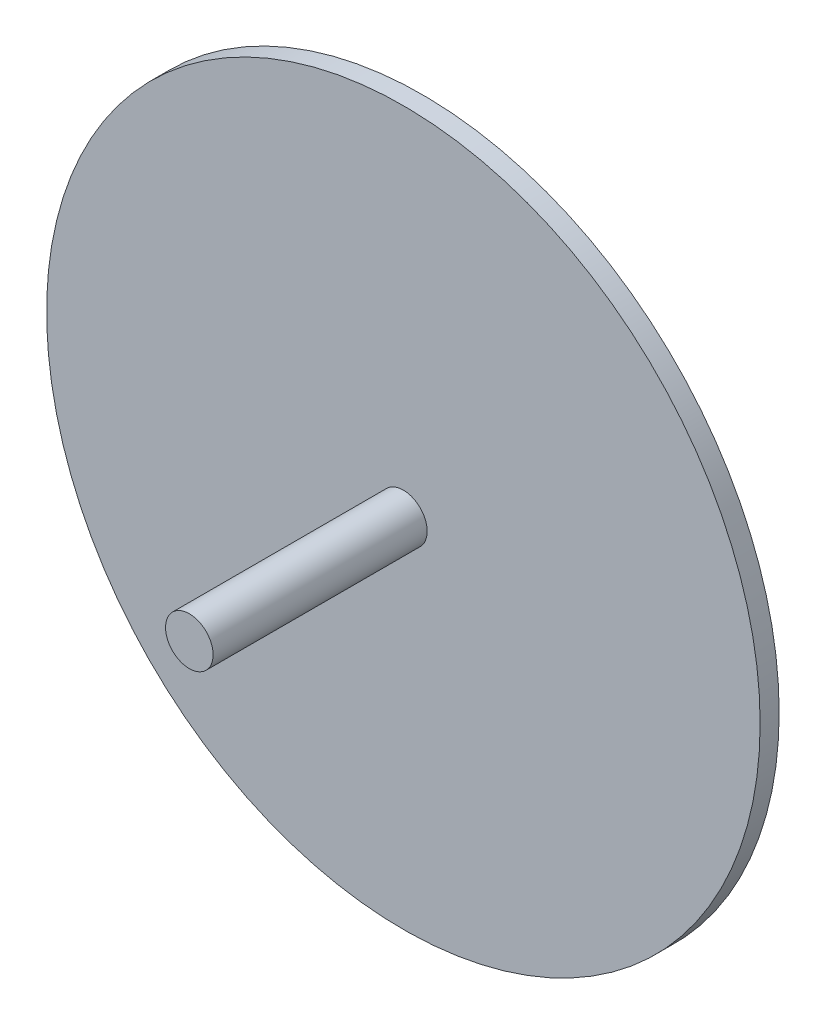
ISO-10303-21;
HEADER;
FILE_DESCRIPTION(('STEP AP214'),'2;1');
FILE_NAME('part.step','',(''),(''),'','','');
FILE_SCHEMA(('AUTOMOTIVE_DESIGN { 1 0 10303 214 1 1 1 1 }'));
ENDSEC;
DATA;
#1=APPLICATION_CONTEXT('core data for automotive mechanical design processes');
#2=APPLICATION_PROTOCOL_DEFINITION('international standard','automotive_design',2000,#1);
#3=PRODUCT_CONTEXT('',#1,'mechanical');
#4=PRODUCT('Part','Part','',(#3));
#5=PRODUCT_RELATED_PRODUCT_CATEGORY('part','',(#4));
#6=PRODUCT_DEFINITION_FORMATION('','',#4);
#7=PRODUCT_DEFINITION_CONTEXT('part definition',#1,'design');
#8=PRODUCT_DEFINITION('design','',#6,#7);
#9=PRODUCT_DEFINITION_SHAPE('','',#8);
#10=(LENGTH_UNIT() NAMED_UNIT(*) SI_UNIT(.MILLI.,.METRE.));
#11=(NAMED_UNIT(*) PLANE_ANGLE_UNIT() SI_UNIT($,.RADIAN.));
#12=(NAMED_UNIT(*) SI_UNIT($,.STERADIAN.) SOLID_ANGLE_UNIT());
#13=UNCERTAINTY_MEASURE_WITH_UNIT(LENGTH_MEASURE(1.E-05),#10,'distance_accuracy_value','');
#14=(GEOMETRIC_REPRESENTATION_CONTEXT(3) GLOBAL_UNCERTAINTY_ASSIGNED_CONTEXT((#13)) GLOBAL_UNIT_ASSIGNED_CONTEXT((#10,
#11,#12)) REPRESENTATION_CONTEXT('',''));
#15=CARTESIAN_POINT('',(0.,0.,0.));
#16=DIRECTION('',(0.,0.,1.));
#17=DIRECTION('',(1.,0.,0.));
#18=AXIS2_PLACEMENT_3D('',#15,#16,#17);
#19=CARTESIAN_POINT('',(0.,0.,4.));
#20=DIRECTION('',(0.,0.,-1.));
#21=DIRECTION('',(-1.,0.,0.));
#22=AXIS2_PLACEMENT_3D('',#19,#20,#21);
#23=CYLINDRICAL_SURFACE('',#22,75.);
#24=CARTESIAN_POINT('',(0.,0.,4.));
#25=DIRECTION('',(0.,0.,1.));
#26=DIRECTION('',(1.,0.,0.));
#27=AXIS2_PLACEMENT_3D('',#24,#25,#26);
#28=CIRCLE('',#27,75.);
#29=CARTESIAN_POINT('',(75.,0.,4.));
#30=VERTEX_POINT('',#29);
#31=EDGE_CURVE('E10',#30,#30,#28,.T.);
#32=ORIENTED_EDGE('',*,*,#31,.F.);
#33=EDGE_LOOP('',(#32));
#34=FACE_BOUND('',#33,.T.);
#35=CARTESIAN_POINT('',(0.,0.,0.));
#36=DIRECTION('',(0.,0.,1.));
#37=DIRECTION('',(1.,0.,0.));
#38=AXIS2_PLACEMENT_3D('',#35,#36,#37);
#39=CIRCLE('',#38,75.);
#40=CARTESIAN_POINT('',(75.,0.,0.));
#41=VERTEX_POINT('',#40);
#42=EDGE_CURVE('E46',#41,#41,#39,.T.);
#43=ORIENTED_EDGE('',*,*,#42,.T.);
#44=EDGE_LOOP('',(#43));
#45=FACE_BOUND('',#44,.T.);
#46=ADVANCED_FACE('F43',(#34,#45),#23,.T.);
#47=CARTESIAN_POINT('',(0.,0.,4.));
#48=DIRECTION('',(0.,0.,1.));
#49=DIRECTION('',(1.,0.,0.));
#50=AXIS2_PLACEMENT_3D('',#47,#48,#49);
#51=PLANE('',#50);
#52=CARTESIAN_POINT('',(0.,0.,4.));
#53=DIRECTION('',(0.,0.,1.));
#54=DIRECTION('',(1.,0.,0.));
#55=AXIS2_PLACEMENT_3D('',#52,#53,#54);
#56=CIRCLE('',#55,5.);
#57=CARTESIAN_POINT('',(5.,0.,4.));
#58=VERTEX_POINT('',#57);
#59=EDGE_CURVE('E57',#58,#58,#56,.T.);
#60=ORIENTED_EDGE('',*,*,#59,.F.);
#61=EDGE_LOOP('',(#60));
#62=FACE_BOUND('',#61,.T.);
#63=ORIENTED_EDGE('',*,*,#31,.T.);
#64=EDGE_LOOP('',(#63));
#65=FACE_BOUND('',#64,.T.);
#66=ADVANCED_FACE('F74',(#62,#65),#51,.T.);
#67=CARTESIAN_POINT('',(0.,0.,0.));
#68=DIRECTION('',(0.,0.,1.));
#69=DIRECTION('',(1.,0.,0.));
#70=AXIS2_PLACEMENT_3D('',#67,#68,#69);
#71=PLANE('',#70);
#72=ORIENTED_EDGE('',*,*,#42,.F.);
#73=EDGE_LOOP('',(#72));
#74=FACE_BOUND('',#73,.T.);
#75=ADVANCED_FACE('F70',(#74),#71,.F.);
#76=CARTESIAN_POINT('',(0.,0.,49.));
#77=DIRECTION('',(0.,0.,-1.));
#78=DIRECTION('',(-1.,0.,0.));
#79=AXIS2_PLACEMENT_3D('',#76,#77,#78);
#80=CYLINDRICAL_SURFACE('',#79,5.);
#81=CARTESIAN_POINT('',(0.,0.,49.));
#82=DIRECTION('',(0.,0.,1.));
#83=DIRECTION('',(1.,0.,0.));
#84=AXIS2_PLACEMENT_3D('',#81,#82,#83);
#85=CIRCLE('',#84,5.);
#86=CARTESIAN_POINT('',(5.,0.,49.));
#87=VERTEX_POINT('',#86);
#88=EDGE_CURVE('E55',#87,#87,#85,.T.);
#89=ORIENTED_EDGE('',*,*,#88,.F.);
#90=EDGE_LOOP('',(#89));
#91=FACE_BOUND('',#90,.T.);
#92=ORIENTED_EDGE('',*,*,#59,.T.);
#93=EDGE_LOOP('',(#92));
#94=FACE_BOUND('',#93,.T.);
#95=ADVANCED_FACE('F67',(#91,#94),#80,.T.);
#96=CARTESIAN_POINT('',(0.,0.,49.));
#97=DIRECTION('',(0.,0.,1.));
#98=DIRECTION('',(1.,0.,0.));
#99=AXIS2_PLACEMENT_3D('',#96,#97,#98);
#100=PLANE('',#99);
#101=ORIENTED_EDGE('',*,*,#88,.T.);
#102=EDGE_LOOP('',(#101));
#103=FACE_BOUND('',#102,.T.);
#104=ADVANCED_FACE('F65',(#103),#100,.T.);
#105=CLOSED_SHELL('',(#46,#66,#75,#95,#104));
#106=MANIFOLD_SOLID_BREP('B2',#105);
#107=ADVANCED_BREP_SHAPE_REPRESENTATION('',(#18,#106),#14);
#108=SHAPE_DEFINITION_REPRESENTATION(#9,#107);
ENDSEC;
END-ISO-10303-21;
